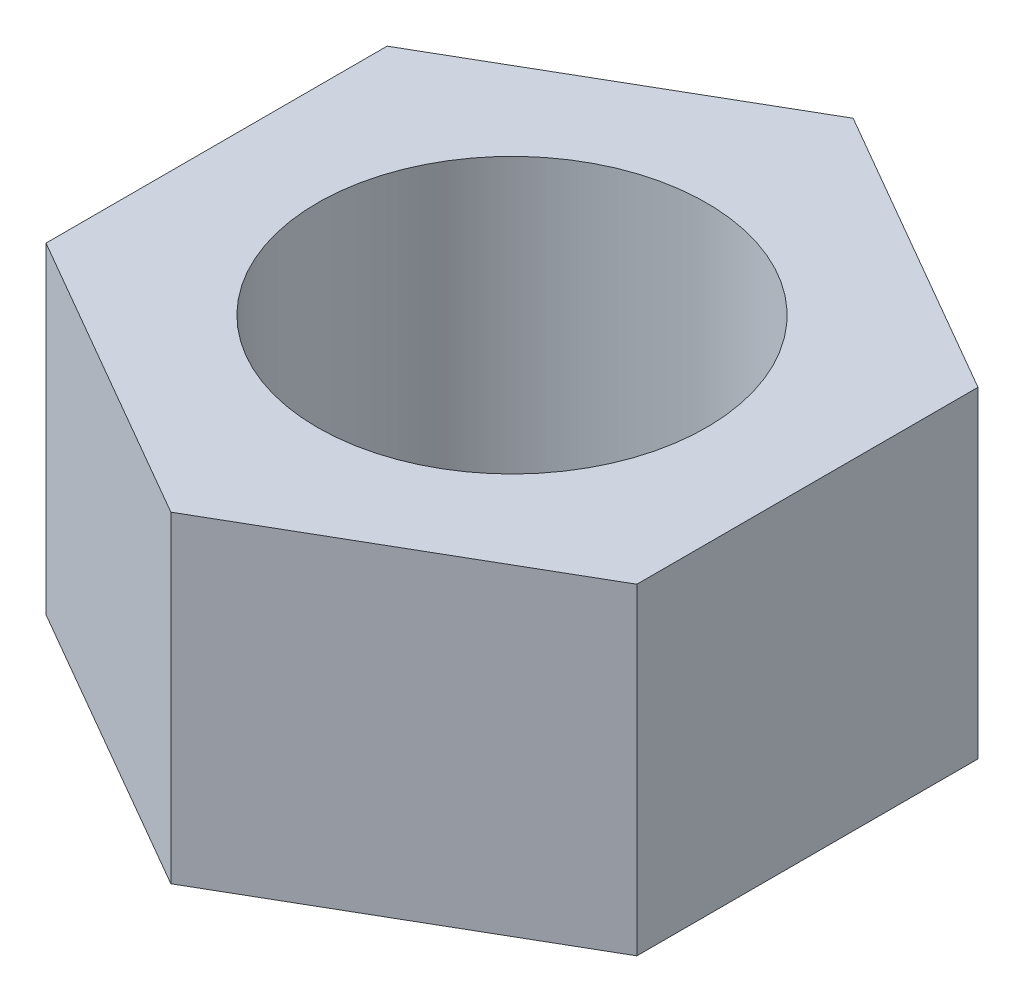
ISO-10303-21;
HEADER;
FILE_DESCRIPTION(('STEP AP214'),'2;1');
FILE_NAME('part.step','',(''),(''),'','','');
FILE_SCHEMA(('AUTOMOTIVE_DESIGN { 1 0 10303 214 1 1 1 1 }'));
ENDSEC;
DATA;
#1=APPLICATION_CONTEXT('core data for automotive mechanical design processes');
#2=APPLICATION_PROTOCOL_DEFINITION('international standard','automotive_design',2000,#1);
#3=PRODUCT_CONTEXT('',#1,'mechanical');
#4=PRODUCT('Part','Part','',(#3));
#5=PRODUCT_RELATED_PRODUCT_CATEGORY('part','',(#4));
#6=PRODUCT_DEFINITION_FORMATION('','',#4);
#7=PRODUCT_DEFINITION_CONTEXT('part definition',#1,'design');
#8=PRODUCT_DEFINITION('design','',#6,#7);
#9=PRODUCT_DEFINITION_SHAPE('','',#8);
#10=(LENGTH_UNIT() NAMED_UNIT(*) SI_UNIT(.MILLI.,.METRE.));
#11=(NAMED_UNIT(*) PLANE_ANGLE_UNIT() SI_UNIT($,.RADIAN.));
#12=(NAMED_UNIT(*) SI_UNIT($,.STERADIAN.) SOLID_ANGLE_UNIT());
#13=UNCERTAINTY_MEASURE_WITH_UNIT(LENGTH_MEASURE(1.E-05),#10,'distance_accuracy_value','');
#14=(GEOMETRIC_REPRESENTATION_CONTEXT(3) GLOBAL_UNCERTAINTY_ASSIGNED_CONTEXT((#13)) GLOBAL_UNIT_ASSIGNED_CONTEXT((#10,
#11,#12)) REPRESENTATION_CONTEXT('',''));
#15=CARTESIAN_POINT('',(0.,0.,0.));
#16=DIRECTION('',(0.,0.,1.));
#17=DIRECTION('',(1.,0.,0.));
#18=AXIS2_PLACEMENT_3D('',#15,#16,#17);
#19=CARTESIAN_POINT('',(0.,6.7,0.));
#20=DIRECTION('',(0.,1.,0.));
#21=DIRECTION('',(0.,0.,1.));
#22=AXIS2_PLACEMENT_3D('',#19,#20,#21);
#23=PLANE('',#22);
#24=DIRECTION('',(0.866025403784438,0.,-0.5));
#25=VECTOR('',#24,1.);
#26=CARTESIAN_POINT('',(-2.98261802575105,6.7,4.07919801060324));
#27=LINE('',#26,#25);
#28=CARTESIAN_POINT('',(-2.98261802575105,6.7,4.07919801060324));
#29=VERTEX_POINT('',#28);
#30=CARTESIAN_POINT('',(3.16738197424895,6.7,0.528493855087039));
#31=VERTEX_POINT('',#30);
#32=EDGE_CURVE('E129',#29,#31,#27,.T.);
#33=ORIENTED_EDGE('',*,*,#32,.T.);
#34=DIRECTION('',(0.,0.,-1.));
#35=VECTOR('',#34,1.);
#36=CARTESIAN_POINT('',(3.16738197424895,6.7,0.528493855087039));
#37=LINE('',#36,#35);
#38=CARTESIAN_POINT('',(3.16738197424895,6.7,-6.57291445594536));
#39=VERTEX_POINT('',#38);
#40=EDGE_CURVE('E87',#31,#39,#37,.T.);
#41=ORIENTED_EDGE('',*,*,#40,.T.);
#42=DIRECTION('',(-0.866025403784439,0.,-0.5));
#43=VECTOR('',#42,1.);
#44=CARTESIAN_POINT('',(3.16738197424895,6.7,-6.57291445594536));
#45=LINE('',#44,#43);
#46=CARTESIAN_POINT('',(-2.98261802575105,6.7,-10.1236186114616));
#47=VERTEX_POINT('',#46);
#48=EDGE_CURVE('E100',#39,#47,#45,.T.);
#49=ORIENTED_EDGE('',*,*,#48,.T.);
#50=DIRECTION('',(-0.866025403784438,0.,0.5));
#51=VECTOR('',#50,1.);
#52=CARTESIAN_POINT('',(-2.98261802575105,6.7,-10.1236186114616));
#53=LINE('',#52,#51);
#54=CARTESIAN_POINT('',(-9.13261802575105,6.7,-6.57291445594536));
#55=VERTEX_POINT('',#54);
#56=EDGE_CURVE('E94',#47,#55,#53,.T.);
#57=ORIENTED_EDGE('',*,*,#56,.T.);
#58=DIRECTION('',(0.,0.,1.));
#59=VECTOR('',#58,1.);
#60=CARTESIAN_POINT('',(-9.13261802575105,6.7,-6.57291445594536));
#61=LINE('',#60,#59);
#62=CARTESIAN_POINT('',(-9.13261802575105,6.7,0.528493855087037));
#63=VERTEX_POINT('',#62);
#64=EDGE_CURVE('E98',#55,#63,#61,.T.);
#65=ORIENTED_EDGE('',*,*,#64,.T.);
#66=DIRECTION('',(0.866025403784439,0.,0.5));
#67=VECTOR('',#66,1.);
#68=CARTESIAN_POINT('',(-9.13261802575105,6.7,0.528493855087037));
#69=LINE('',#68,#67);
#70=EDGE_CURVE('E50',#63,#29,#69,.T.);
#71=ORIENTED_EDGE('',*,*,#70,.T.);
#72=EDGE_LOOP('',(#33,#41,#49,#57,#65,#71));
#73=FACE_BOUND('',#72,.T.);
#74=CARTESIAN_POINT('',(-2.98261802575105,6.7,-3.02221030042916));
#75=DIRECTION('',(0.,1.,0.));
#76=DIRECTION('',(0.,0.,1.));
#77=AXIS2_PLACEMENT_3D('',#74,#75,#76);
#78=CIRCLE('',#77,4.05);
#79=CARTESIAN_POINT('',(-2.98261802575105,6.7,1.02778969957084));
#80=VERTEX_POINT('',#79);
#81=EDGE_CURVE('E122',#80,#80,#78,.T.);
#82=ORIENTED_EDGE('',*,*,#81,.F.);
#83=EDGE_LOOP('',(#82));
#84=FACE_BOUND('',#83,.T.);
#85=ADVANCED_FACE('F33',(#73,#84),#23,.T.);
#86=CARTESIAN_POINT('',(0.,0.,0.));
#87=DIRECTION('',(0.,1.,0.));
#88=DIRECTION('',(0.,0.,1.));
#89=AXIS2_PLACEMENT_3D('',#86,#87,#88);
#90=PLANE('',#89);
#91=DIRECTION('',(0.866025403784438,0.,-0.5));
#92=VECTOR('',#91,1.);
#93=CARTESIAN_POINT('',(-2.98261802575105,0.,4.07919801060324));
#94=LINE('',#93,#92);
#95=CARTESIAN_POINT('',(-2.98261802575105,0.,4.07919801060324));
#96=VERTEX_POINT('',#95);
#97=CARTESIAN_POINT('',(3.16738197424895,0.,0.528493855087039));
#98=VERTEX_POINT('',#97);
#99=EDGE_CURVE('E118',#96,#98,#94,.T.);
#100=ORIENTED_EDGE('',*,*,#99,.F.);
#101=DIRECTION('',(0.866025403784439,0.,0.5));
#102=VECTOR('',#101,1.);
#103=CARTESIAN_POINT('',(-9.13261802575105,0.,0.528493855087037));
#104=LINE('',#103,#102);
#105=CARTESIAN_POINT('',(-9.13261802575105,0.,0.528493855087037));
#106=VERTEX_POINT('',#105);
#107=EDGE_CURVE('E79',#106,#96,#104,.T.);
#108=ORIENTED_EDGE('',*,*,#107,.F.);
#109=DIRECTION('',(0.,0.,1.));
#110=VECTOR('',#109,1.);
#111=CARTESIAN_POINT('',(-9.13261802575105,0.,-6.57291445594536));
#112=LINE('',#111,#110);
#113=CARTESIAN_POINT('',(-9.13261802575105,0.,-6.57291445594536));
#114=VERTEX_POINT('',#113);
#115=EDGE_CURVE('E73',#114,#106,#112,.T.);
#116=ORIENTED_EDGE('',*,*,#115,.F.);
#117=DIRECTION('',(-0.866025403784438,0.,0.5));
#118=VECTOR('',#117,1.);
#119=CARTESIAN_POINT('',(-2.98261802575105,0.,-10.1236186114616));
#120=LINE('',#119,#118);
#121=CARTESIAN_POINT('',(-2.98261802575105,0.,-10.1236186114616));
#122=VERTEX_POINT('',#121);
#123=EDGE_CURVE('E108',#122,#114,#120,.T.);
#124=ORIENTED_EDGE('',*,*,#123,.F.);
#125=DIRECTION('',(-0.866025403784439,0.,-0.5));
#126=VECTOR('',#125,1.);
#127=CARTESIAN_POINT('',(3.16738197424895,0.,-6.57291445594536));
#128=LINE('',#127,#126);
#129=CARTESIAN_POINT('',(3.16738197424895,0.,-6.57291445594536));
#130=VERTEX_POINT('',#129);
#131=EDGE_CURVE('E124',#130,#122,#128,.T.);
#132=ORIENTED_EDGE('',*,*,#131,.F.);
#133=DIRECTION('',(0.,0.,-1.));
#134=VECTOR('',#133,1.);
#135=CARTESIAN_POINT('',(3.16738197424895,0.,0.528493855087039));
#136=LINE('',#135,#134);
#137=EDGE_CURVE('E121',#98,#130,#136,.T.);
#138=ORIENTED_EDGE('',*,*,#137,.F.);
#139=EDGE_LOOP('',(#100,#108,#116,#124,#132,#138));
#140=FACE_BOUND('',#139,.T.);
#141=CARTESIAN_POINT('',(-2.98261802575105,0.,-3.02221030042916));
#142=DIRECTION('',(0.,1.,0.));
#143=DIRECTION('',(0.,0.,1.));
#144=AXIS2_PLACEMENT_3D('',#141,#142,#143);
#145=CIRCLE('',#144,4.05);
#146=CARTESIAN_POINT('',(-2.98261802575105,0.,1.02778969957084));
#147=VERTEX_POINT('',#146);
#148=EDGE_CURVE('E222',#147,#147,#145,.T.);
#149=ORIENTED_EDGE('',*,*,#148,.T.);
#150=EDGE_LOOP('',(#149));
#151=FACE_BOUND('',#150,.T.);
#152=ADVANCED_FACE('F138',(#140,#151),#90,.F.);
#153=CARTESIAN_POINT('',(-2.98261802575105,6.7,4.07919801060324));
#154=DIRECTION('',(-0.5,0.,-0.866025403784438));
#155=DIRECTION('',(-0.866025403784439,0.,0.5));
#156=AXIS2_PLACEMENT_3D('',#153,#154,#155);
#157=PLANE('',#156);
#158=ORIENTED_EDGE('',*,*,#99,.T.);
#159=DIRECTION('',(0.,-1.,0.));
#160=VECTOR('',#159,1.);
#161=CARTESIAN_POINT('',(3.16738197424895,6.7,0.528493855087039));
#162=LINE('',#161,#160);
#163=EDGE_CURVE('E11',#31,#98,#162,.T.);
#164=ORIENTED_EDGE('',*,*,#163,.F.);
#165=ORIENTED_EDGE('',*,*,#32,.F.);
#166=DIRECTION('',(0.,-1.,0.));
#167=VECTOR('',#166,1.);
#168=CARTESIAN_POINT('',(-2.98261802575105,6.7,4.07919801060324));
#169=LINE('',#168,#167);
#170=EDGE_CURVE('E114',#29,#96,#169,.T.);
#171=ORIENTED_EDGE('',*,*,#170,.T.);
#172=EDGE_LOOP('',(#158,#164,#165,#171));
#173=FACE_BOUND('',#172,.T.);
#174=ADVANCED_FACE('F35',(#173),#157,.F.);
#175=CARTESIAN_POINT('',(3.16738197424895,6.7,0.528493855087039));
#176=DIRECTION('',(-1.,0.,0.));
#177=DIRECTION('',(0.,0.,1.));
#178=AXIS2_PLACEMENT_3D('',#175,#176,#177);
#179=PLANE('',#178);
#180=ORIENTED_EDGE('',*,*,#137,.T.);
#181=DIRECTION('',(0.,-1.,0.));
#182=VECTOR('',#181,1.);
#183=CARTESIAN_POINT('',(3.16738197424895,6.7,-6.57291445594536));
#184=LINE('',#183,#182);
#185=EDGE_CURVE('E42',#39,#130,#184,.T.);
#186=ORIENTED_EDGE('',*,*,#185,.F.);
#187=ORIENTED_EDGE('',*,*,#40,.F.);
#188=ORIENTED_EDGE('',*,*,#163,.T.);
#189=EDGE_LOOP('',(#180,#186,#187,#188));
#190=FACE_BOUND('',#189,.T.);
#191=ADVANCED_FACE('F163',(#190),#179,.F.);
#192=CARTESIAN_POINT('',(3.16738197424895,6.7,-6.57291445594536));
#193=DIRECTION('',(-0.5,0.,0.866025403784439));
#194=DIRECTION('',(0.866025403784439,0.,0.5));
#195=AXIS2_PLACEMENT_3D('',#192,#193,#194);
#196=PLANE('',#195);
#197=ORIENTED_EDGE('',*,*,#131,.T.);
#198=DIRECTION('',(0.,-1.,0.));
#199=VECTOR('',#198,1.);
#200=CARTESIAN_POINT('',(-2.98261802575105,6.7,-10.1236186114616));
#201=LINE('',#200,#199);
#202=EDGE_CURVE('E109',#47,#122,#201,.T.);
#203=ORIENTED_EDGE('',*,*,#202,.F.);
#204=ORIENTED_EDGE('',*,*,#48,.F.);
#205=ORIENTED_EDGE('',*,*,#185,.T.);
#206=EDGE_LOOP('',(#197,#203,#204,#205));
#207=FACE_BOUND('',#206,.T.);
#208=ADVANCED_FACE('F135',(#207),#196,.F.);
#209=CARTESIAN_POINT('',(-2.98261802575105,6.7,-10.1236186114616));
#210=DIRECTION('',(0.5,0.,0.866025403784438));
#211=DIRECTION('',(0.866025403784439,0.,-0.5));
#212=AXIS2_PLACEMENT_3D('',#209,#210,#211);
#213=PLANE('',#212);
#214=ORIENTED_EDGE('',*,*,#123,.T.);
#215=DIRECTION('',(0.,-1.,0.));
#216=VECTOR('',#215,1.);
#217=CARTESIAN_POINT('',(-9.13261802575105,6.7,-6.57291445594536));
#218=LINE('',#217,#216);
#219=EDGE_CURVE('E105',#55,#114,#218,.T.);
#220=ORIENTED_EDGE('',*,*,#219,.F.);
#221=ORIENTED_EDGE('',*,*,#56,.F.);
#222=ORIENTED_EDGE('',*,*,#202,.T.);
#223=EDGE_LOOP('',(#214,#220,#221,#222));
#224=FACE_BOUND('',#223,.T.);
#225=ADVANCED_FACE('F106',(#224),#213,.F.);
#226=CARTESIAN_POINT('',(-9.13261802575105,6.7,-6.57291445594536));
#227=DIRECTION('',(1.,0.,0.));
#228=DIRECTION('',(0.,0.,-1.));
#229=AXIS2_PLACEMENT_3D('',#226,#227,#228);
#230=PLANE('',#229);
#231=ORIENTED_EDGE('',*,*,#115,.T.);
#232=DIRECTION('',(0.,-1.,0.));
#233=VECTOR('',#232,1.);
#234=CARTESIAN_POINT('',(-9.13261802575105,6.7,0.528493855087037));
#235=LINE('',#234,#233);
#236=EDGE_CURVE('E110',#63,#106,#235,.T.);
#237=ORIENTED_EDGE('',*,*,#236,.F.);
#238=ORIENTED_EDGE('',*,*,#64,.F.);
#239=ORIENTED_EDGE('',*,*,#219,.T.);
#240=EDGE_LOOP('',(#231,#237,#238,#239));
#241=FACE_BOUND('',#240,.T.);
#242=ADVANCED_FACE('F112',(#241),#230,.F.);
#243=CARTESIAN_POINT('',(-9.13261802575105,6.7,0.528493855087037));
#244=DIRECTION('',(0.5,0.,-0.866025403784439));
#245=DIRECTION('',(-0.866025403784439,0.,-0.5));
#246=AXIS2_PLACEMENT_3D('',#243,#244,#245);
#247=PLANE('',#246);
#248=ORIENTED_EDGE('',*,*,#107,.T.);
#249=ORIENTED_EDGE('',*,*,#170,.F.);
#250=ORIENTED_EDGE('',*,*,#70,.F.);
#251=ORIENTED_EDGE('',*,*,#236,.T.);
#252=EDGE_LOOP('',(#248,#249,#250,#251));
#253=FACE_BOUND('',#252,.T.);
#254=ADVANCED_FACE('F143',(#253),#247,.F.);
#255=CARTESIAN_POINT('',(-2.98261802575105,6.7,-3.02221030042916));
#256=DIRECTION('',(0.,-1.,0.));
#257=DIRECTION('',(0.,0.,-1.));
#258=AXIS2_PLACEMENT_3D('',#255,#256,#257);
#259=CYLINDRICAL_SURFACE('',#258,4.05);
#260=ORIENTED_EDGE('',*,*,#81,.T.);
#261=EDGE_LOOP('',(#260));
#262=FACE_BOUND('',#261,.T.);
#263=ORIENTED_EDGE('',*,*,#148,.F.);
#264=EDGE_LOOP('',(#263));
#265=FACE_BOUND('',#264,.T.);
#266=ADVANCED_FACE('F145',(#262,#265),#259,.F.);
#267=CLOSED_SHELL('',(#85,#152,#174,#191,#208,#225,#242,#254,#266));
#268=MANIFOLD_SOLID_BREP('B2',#267);
#269=ADVANCED_BREP_SHAPE_REPRESENTATION('',(#18,#268),#14);
#270=SHAPE_DEFINITION_REPRESENTATION(#9,#269);
ENDSEC;
END-ISO-10303-21;
